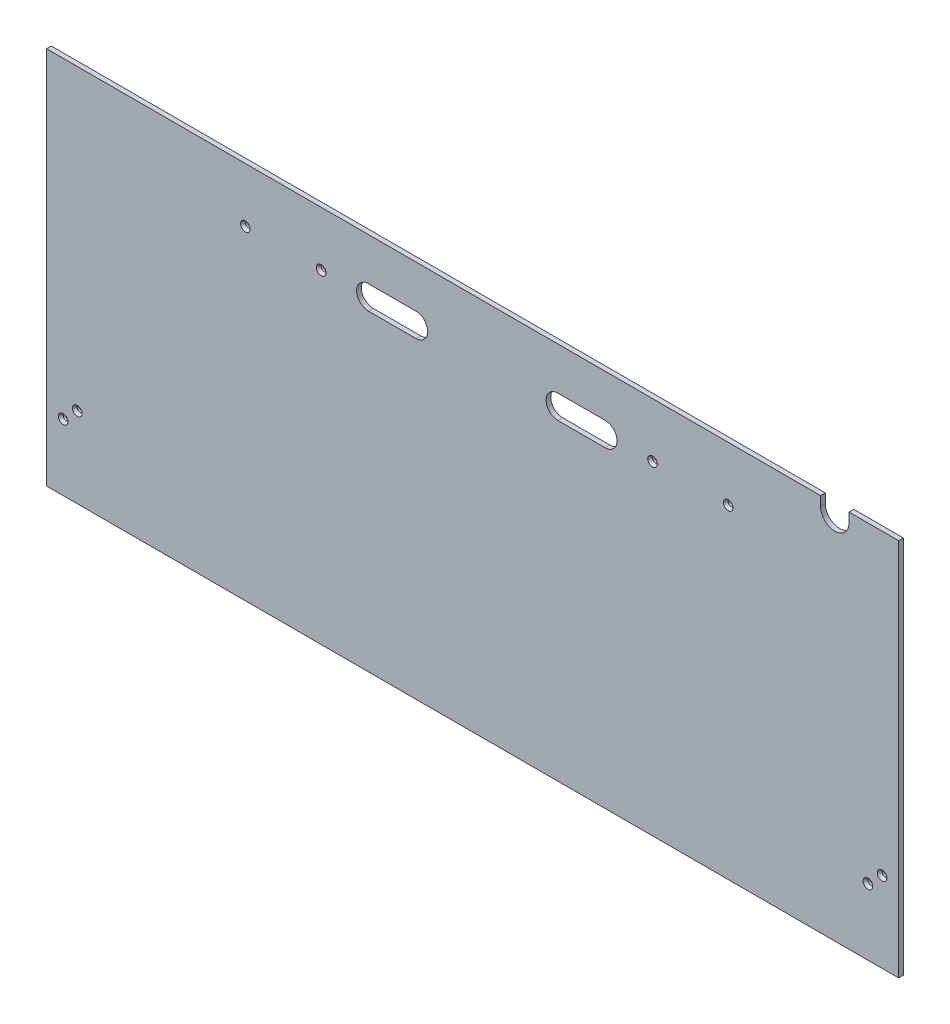
ISO-10303-21;
HEADER;
FILE_DESCRIPTION(('STEP AP214'),'2;1');
FILE_NAME('part.step','',(''),(''),'','','');
FILE_SCHEMA(('AUTOMOTIVE_DESIGN { 1 0 10303 214 1 1 1 1 }'));
ENDSEC;
DATA;
#1=APPLICATION_CONTEXT('core data for automotive mechanical design processes');
#2=APPLICATION_PROTOCOL_DEFINITION('international standard','automotive_design',2000,#1);
#3=PRODUCT_CONTEXT('',#1,'mechanical');
#4=PRODUCT('Part','Part','',(#3));
#5=PRODUCT_RELATED_PRODUCT_CATEGORY('part','',(#4));
#6=PRODUCT_DEFINITION_FORMATION('','',#4);
#7=PRODUCT_DEFINITION_CONTEXT('part definition',#1,'design');
#8=PRODUCT_DEFINITION('design','',#6,#7);
#9=PRODUCT_DEFINITION_SHAPE('','',#8);
#10=(LENGTH_UNIT() NAMED_UNIT(*) SI_UNIT(.MILLI.,.METRE.));
#11=(NAMED_UNIT(*) PLANE_ANGLE_UNIT() SI_UNIT($,.RADIAN.));
#12=(NAMED_UNIT(*) SI_UNIT($,.STERADIAN.) SOLID_ANGLE_UNIT());
#13=UNCERTAINTY_MEASURE_WITH_UNIT(LENGTH_MEASURE(1.E-05),#10,'distance_accuracy_value','');
#14=(GEOMETRIC_REPRESENTATION_CONTEXT(3) GLOBAL_UNCERTAINTY_ASSIGNED_CONTEXT((#13)) GLOBAL_UNIT_ASSIGNED_CONTEXT((#10,
#11,#12)) REPRESENTATION_CONTEXT('',''));
#15=CARTESIAN_POINT('',(0.,0.,0.));
#16=DIRECTION('',(0.,0.,1.));
#17=DIRECTION('',(1.,0.,0.));
#18=AXIS2_PLACEMENT_3D('',#15,#16,#17);
#19=CARTESIAN_POINT('',(0.,508.,6.35));
#20=DIRECTION('',(0.,-1.,0.));
#21=DIRECTION('',(0.,0.,-1.));
#22=AXIS2_PLACEMENT_3D('',#19,#20,#21);
#23=PLANE('',#22);
#24=DIRECTION('',(-1.,0.,0.));
#25=VECTOR('',#24,1.);
#26=CARTESIAN_POINT('',(0.,508.,6.35));
#27=LINE('',#26,#25);
#28=CARTESIAN_POINT('',(1038.225,508.,6.35));
#29=VERTEX_POINT('',#28);
#30=CARTESIAN_POINT('',(0.,508.,6.35));
#31=VERTEX_POINT('',#30);
#32=EDGE_CURVE('E326',#29,#31,#27,.T.);
#33=ORIENTED_EDGE('',*,*,#32,.F.);
#34=DIRECTION('',(0.,0.,1.));
#35=VECTOR('',#34,1.);
#36=CARTESIAN_POINT('',(1038.225,508.,0.));
#37=LINE('',#36,#35);
#38=CARTESIAN_POINT('',(1038.225,508.,0.));
#39=VERTEX_POINT('',#38);
#40=EDGE_CURVE('E177',#39,#29,#37,.T.);
#41=ORIENTED_EDGE('',*,*,#40,.F.);
#42=DIRECTION('',(-1.,0.,0.));
#43=VECTOR('',#42,1.);
#44=CARTESIAN_POINT('',(0.,508.,0.));
#45=LINE('',#44,#43);
#46=CARTESIAN_POINT('',(0.,508.,0.));
#47=VERTEX_POINT('',#46);
#48=EDGE_CURVE('E168',#39,#47,#45,.T.);
#49=ORIENTED_EDGE('',*,*,#48,.T.);
#50=DIRECTION('',(0.,0.,-1.));
#51=VECTOR('',#50,1.);
#52=CARTESIAN_POINT('',(0.,508.,6.35));
#53=LINE('',#52,#51);
#54=EDGE_CURVE('E330',#31,#47,#53,.T.);
#55=ORIENTED_EDGE('',*,*,#54,.F.);
#56=EDGE_LOOP('',(#33,#41,#49,#55));
#57=FACE_BOUND('',#56,.T.);
#58=ADVANCED_FACE('F34',(#57),#23,.F.);
#59=CARTESIAN_POINT('',(0.,0.,6.35));
#60=DIRECTION('',(0.,0.,-1.));
#61=DIRECTION('',(-1.,0.,0.));
#62=AXIS2_PLACEMENT_3D('',#59,#60,#61);
#63=PLANE('',#62);
#64=CARTESIAN_POINT('',(368.3,434.975,6.35));
#65=DIRECTION('',(0.,0.,1.));
#66=DIRECTION('',(1.,0.,0.));
#67=AXIS2_PLACEMENT_3D('',#64,#65,#66);
#68=CIRCLE('',#67,6.43890000000003);
#69=CARTESIAN_POINT('',(374.7389,434.975,6.35));
#70=VERTEX_POINT('',#69);
#71=EDGE_CURVE('E201',#70,#70,#68,.T.);
#72=ORIENTED_EDGE('',*,*,#71,.F.);
#73=EDGE_LOOP('',(#72));
#74=FACE_BOUND('',#73,.T.);
#75=DIRECTION('',(1.,0.,0.));
#76=VECTOR('',#75,1.);
#77=CARTESIAN_POINT('',(431.8,419.1,6.35));
#78=LINE('',#77,#76);
#79=CARTESIAN_POINT('',(431.8,419.1,6.35));
#80=VERTEX_POINT('',#79);
#81=CARTESIAN_POINT('',(495.3,419.1,6.35));
#82=VERTEX_POINT('',#81);
#83=EDGE_CURVE('E271',#80,#82,#78,.T.);
#84=ORIENTED_EDGE('',*,*,#83,.F.);
#85=CARTESIAN_POINT('',(431.8,434.975,6.35));
#86=DIRECTION('',(0.,0.,1.));
#87=DIRECTION('',(1.,0.,0.));
#88=AXIS2_PLACEMENT_3D('',#85,#86,#87);
#89=CIRCLE('',#88,15.875);
#90=CARTESIAN_POINT('',(431.8,450.85,6.35));
#91=VERTEX_POINT('',#90);
#92=EDGE_CURVE('E57',#91,#80,#89,.T.);
#93=ORIENTED_EDGE('',*,*,#92,.F.);
#94=DIRECTION('',(-1.,0.,0.));
#95=VECTOR('',#94,1.);
#96=CARTESIAN_POINT('',(431.8,450.85,6.35));
#97=LINE('',#96,#95);
#98=CARTESIAN_POINT('',(495.3,450.85,6.35));
#99=VERTEX_POINT('',#98);
#100=EDGE_CURVE('E260',#99,#91,#97,.T.);
#101=ORIENTED_EDGE('',*,*,#100,.F.);
#102=CARTESIAN_POINT('',(495.3,434.975,6.35));
#103=DIRECTION('',(0.,0.,1.));
#104=DIRECTION('',(1.,0.,0.));
#105=AXIS2_PLACEMENT_3D('',#102,#103,#104);
#106=CIRCLE('',#105,15.875);
#107=EDGE_CURVE('E275',#82,#99,#106,.T.);
#108=ORIENTED_EDGE('',*,*,#107,.F.);
#109=EDGE_LOOP('',(#84,#93,#101,#108));
#110=FACE_BOUND('',#109,.T.);
#111=DIRECTION('',(1.,0.,0.));
#112=VECTOR('',#111,1.);
#113=CARTESIAN_POINT('',(685.8,419.1,6.35));
#114=LINE('',#113,#112);
#115=CARTESIAN_POINT('',(685.8,419.1,6.35));
#116=VERTEX_POINT('',#115);
#117=CARTESIAN_POINT('',(749.3,419.1,6.35));
#118=VERTEX_POINT('',#117);
#119=EDGE_CURVE('E303',#116,#118,#114,.T.);
#120=ORIENTED_EDGE('',*,*,#119,.F.);
#121=CARTESIAN_POINT('',(685.8,434.975,6.35));
#122=DIRECTION('',(0.,0.,1.));
#123=DIRECTION('',(1.,0.,0.));
#124=AXIS2_PLACEMENT_3D('',#121,#122,#123);
#125=CIRCLE('',#124,15.875);
#126=CARTESIAN_POINT('',(685.8,450.85,6.35));
#127=VERTEX_POINT('',#126);
#128=EDGE_CURVE('E255',#127,#116,#125,.T.);
#129=ORIENTED_EDGE('',*,*,#128,.F.);
#130=DIRECTION('',(-1.,0.,0.));
#131=VECTOR('',#130,1.);
#132=CARTESIAN_POINT('',(685.8,450.85,6.35));
#133=LINE('',#132,#131);
#134=CARTESIAN_POINT('',(749.3,450.85,6.35));
#135=VERTEX_POINT('',#134);
#136=EDGE_CURVE('E292',#135,#127,#133,.T.);
#137=ORIENTED_EDGE('',*,*,#136,.F.);
#138=CARTESIAN_POINT('',(749.3,434.975,6.35));
#139=DIRECTION('',(0.,0.,1.));
#140=DIRECTION('',(1.,0.,0.));
#141=AXIS2_PLACEMENT_3D('',#138,#139,#140);
#142=CIRCLE('',#141,15.875);
#143=EDGE_CURVE('E306',#118,#135,#142,.T.);
#144=ORIENTED_EDGE('',*,*,#143,.F.);
#145=EDGE_LOOP('',(#120,#129,#137,#144));
#146=FACE_BOUND('',#145,.T.);
#147=CARTESIAN_POINT('',(1057.275,495.3,6.35));
#148=DIRECTION('',(0.,0.,1.));
#149=DIRECTION('',(-1.,0.,0.));
#150=AXIS2_PLACEMENT_3D('',#147,#148,#149);
#151=CIRCLE('',#150,19.05);
#152=CARTESIAN_POINT('',(1038.225,495.3,6.35));
#153=VERTEX_POINT('',#152);
#154=CARTESIAN_POINT('',(1076.325,495.3,6.35));
#155=VERTEX_POINT('',#154);
#156=EDGE_CURVE('E171',#153,#155,#151,.T.);
#157=ORIENTED_EDGE('',*,*,#156,.F.);
#158=DIRECTION('',(0.,-1.,0.));
#159=VECTOR('',#158,1.);
#160=CARTESIAN_POINT('',(1038.225,508.,6.35));
#161=LINE('',#160,#159);
#162=EDGE_CURVE('E153',#29,#153,#161,.T.);
#163=ORIENTED_EDGE('',*,*,#162,.F.);
#164=ORIENTED_EDGE('',*,*,#32,.T.);
#165=DIRECTION('',(0.,-1.,0.));
#166=VECTOR('',#165,1.);
#167=CARTESIAN_POINT('',(0.,0.,6.35));
#168=LINE('',#167,#166);
#169=CARTESIAN_POINT('',(0.,0.,6.35));
#170=VERTEX_POINT('',#169);
#171=EDGE_CURVE('E318',#31,#170,#168,.T.);
#172=ORIENTED_EDGE('',*,*,#171,.T.);
#173=DIRECTION('',(1.,0.,0.));
#174=VECTOR('',#173,1.);
#175=CARTESIAN_POINT('',(0.,0.,6.35));
#176=LINE('',#175,#174);
#177=CARTESIAN_POINT('',(1143.,0.,6.35));
#178=VERTEX_POINT('',#177);
#179=EDGE_CURVE('E321',#170,#178,#176,.T.);
#180=ORIENTED_EDGE('',*,*,#179,.T.);
#181=DIRECTION('',(0.,1.,0.));
#182=VECTOR('',#181,1.);
#183=CARTESIAN_POINT('',(1143.,0.,6.35));
#184=LINE('',#183,#182);
#185=CARTESIAN_POINT('',(1143.,508.,6.35));
#186=VERTEX_POINT('',#185);
#187=EDGE_CURVE('E324',#178,#186,#184,.T.);
#188=ORIENTED_EDGE('',*,*,#187,.T.);
#189=CARTESIAN_POINT('',(1076.325,508.,6.35));
#190=VERTEX_POINT('',#189);
#191=EDGE_CURVE('E327',#186,#190,#27,.T.);
#192=ORIENTED_EDGE('',*,*,#191,.T.);
#193=DIRECTION('',(0.,1.,0.));
#194=VECTOR('',#193,1.);
#195=CARTESIAN_POINT('',(1076.325,508.,6.35));
#196=LINE('',#195,#194);
#197=EDGE_CURVE('E169',#155,#190,#196,.T.);
#198=ORIENTED_EDGE('',*,*,#197,.F.);
#199=EDGE_LOOP('',(#157,#163,#164,#172,#180,#188,#192,#198));
#200=FACE_BOUND('',#199,.T.);
#201=CARTESIAN_POINT('',(22.2249999999999,88.9,6.35));
#202=DIRECTION('',(0.,0.,1.));
#203=DIRECTION('',(1.,0.,0.));
#204=AXIS2_PLACEMENT_3D('',#201,#202,#203);
#205=CIRCLE('',#204,6.4389);
#206=CARTESIAN_POINT('',(28.6638999999999,88.9,6.35));
#207=VERTEX_POINT('',#206);
#208=EDGE_CURVE('E246',#207,#207,#205,.T.);
#209=ORIENTED_EDGE('',*,*,#208,.F.);
#210=EDGE_LOOP('',(#209));
#211=FACE_BOUND('',#210,.T.);
#212=CARTESIAN_POINT('',(41.2749999999999,107.95,6.35));
#213=DIRECTION('',(0.,0.,1.));
#214=DIRECTION('',(1.,0.,0.));
#215=AXIS2_PLACEMENT_3D('',#212,#213,#214);
#216=CIRCLE('',#215,6.4389);
#217=CARTESIAN_POINT('',(47.7138999999999,107.95,6.35));
#218=VERTEX_POINT('',#217);
#219=EDGE_CURVE('E237',#218,#218,#216,.T.);
#220=ORIENTED_EDGE('',*,*,#219,.F.);
#221=EDGE_LOOP('',(#220));
#222=FACE_BOUND('',#221,.T.);
#223=CARTESIAN_POINT('',(1101.725,88.9,6.35));
#224=DIRECTION('',(0.,0.,1.));
#225=DIRECTION('',(1.,0.,0.));
#226=AXIS2_PLACEMENT_3D('',#223,#224,#225);
#227=CIRCLE('',#226,6.43890000000003);
#228=CARTESIAN_POINT('',(1108.1639,88.9,6.35));
#229=VERTEX_POINT('',#228);
#230=EDGE_CURVE('E228',#229,#229,#227,.T.);
#231=ORIENTED_EDGE('',*,*,#230,.F.);
#232=EDGE_LOOP('',(#231));
#233=FACE_BOUND('',#232,.T.);
#234=CARTESIAN_POINT('',(1120.775,107.95,6.35));
#235=DIRECTION('',(0.,0.,1.));
#236=DIRECTION('',(1.,0.,0.));
#237=AXIS2_PLACEMENT_3D('',#234,#235,#236);
#238=CIRCLE('',#237,6.43890000000003);
#239=CARTESIAN_POINT('',(1127.2139,107.95,6.35));
#240=VERTEX_POINT('',#239);
#241=EDGE_CURVE('E219',#240,#240,#238,.T.);
#242=ORIENTED_EDGE('',*,*,#241,.F.);
#243=EDGE_LOOP('',(#242));
#244=FACE_BOUND('',#243,.T.);
#245=CARTESIAN_POINT('',(266.7,434.975,6.35));
#246=DIRECTION('',(0.,0.,1.));
#247=DIRECTION('',(1.,0.,0.));
#248=AXIS2_PLACEMENT_3D('',#245,#246,#247);
#249=CIRCLE('',#248,6.43890000000003);
#250=CARTESIAN_POINT('',(273.1389,434.975,6.35));
#251=VERTEX_POINT('',#250);
#252=EDGE_CURVE('E210',#251,#251,#249,.T.);
#253=ORIENTED_EDGE('',*,*,#252,.F.);
#254=EDGE_LOOP('',(#253));
#255=FACE_BOUND('',#254,.T.);
#256=CARTESIAN_POINT('',(812.8,434.975,6.35));
#257=DIRECTION('',(0.,0.,1.));
#258=DIRECTION('',(1.,0.,0.));
#259=AXIS2_PLACEMENT_3D('',#256,#257,#258);
#260=CIRCLE('',#259,6.43890000000003);
#261=CARTESIAN_POINT('',(819.2389,434.975,6.35));
#262=VERTEX_POINT('',#261);
#263=EDGE_CURVE('E192',#262,#262,#260,.T.);
#264=ORIENTED_EDGE('',*,*,#263,.F.);
#265=EDGE_LOOP('',(#264));
#266=FACE_BOUND('',#265,.T.);
#267=CARTESIAN_POINT('',(914.4,434.975,6.35));
#268=DIRECTION('',(0.,0.,1.));
#269=DIRECTION('',(1.,0.,0.));
#270=AXIS2_PLACEMENT_3D('',#267,#268,#269);
#271=CIRCLE('',#270,6.43890000000003);
#272=CARTESIAN_POINT('',(920.8389,434.975,6.35));
#273=VERTEX_POINT('',#272);
#274=EDGE_CURVE('E179',#273,#273,#271,.T.);
#275=ORIENTED_EDGE('',*,*,#274,.F.);
#276=EDGE_LOOP('',(#275));
#277=FACE_BOUND('',#276,.T.);
#278=ADVANCED_FACE('F357',(#74,#110,#146,#200,#211,#222,#233,#244,#255,#266,#277),#63,.F.);
#279=CARTESIAN_POINT('',(0.,0.,6.35));
#280=DIRECTION('',(1.,0.,0.));
#281=DIRECTION('',(0.,0.,-1.));
#282=AXIS2_PLACEMENT_3D('',#279,#280,#281);
#283=PLANE('',#282);
#284=DIRECTION('',(0.,-1.,0.));
#285=VECTOR('',#284,1.);
#286=CARTESIAN_POINT('',(0.,0.,0.));
#287=LINE('',#286,#285);
#288=CARTESIAN_POINT('',(0.,0.,0.));
#289=VERTEX_POINT('',#288);
#290=EDGE_CURVE('E282',#47,#289,#287,.T.);
#291=ORIENTED_EDGE('',*,*,#290,.T.);
#292=DIRECTION('',(0.,0.,-1.));
#293=VECTOR('',#292,1.);
#294=CARTESIAN_POINT('',(0.,0.,6.35));
#295=LINE('',#294,#293);
#296=EDGE_CURVE('E11',#170,#289,#295,.T.);
#297=ORIENTED_EDGE('',*,*,#296,.F.);
#298=ORIENTED_EDGE('',*,*,#171,.F.);
#299=ORIENTED_EDGE('',*,*,#54,.T.);
#300=EDGE_LOOP('',(#291,#297,#298,#299));
#301=FACE_BOUND('',#300,.T.);
#302=ADVANCED_FACE('F36',(#301),#283,.F.);
#303=CARTESIAN_POINT('',(0.,0.,6.35));
#304=DIRECTION('',(0.,1.,0.));
#305=DIRECTION('',(0.,0.,1.));
#306=AXIS2_PLACEMENT_3D('',#303,#304,#305);
#307=PLANE('',#306);
#308=DIRECTION('',(1.,0.,0.));
#309=VECTOR('',#308,1.);
#310=CARTESIAN_POINT('',(0.,0.,0.));
#311=LINE('',#310,#309);
#312=CARTESIAN_POINT('',(1143.,0.,0.));
#313=VERTEX_POINT('',#312);
#314=EDGE_CURVE('E333',#289,#313,#311,.T.);
#315=ORIENTED_EDGE('',*,*,#314,.T.);
#316=DIRECTION('',(0.,0.,-1.));
#317=VECTOR('',#316,1.);
#318=CARTESIAN_POINT('',(1143.,0.,6.35));
#319=LINE('',#318,#317);
#320=EDGE_CURVE('E42',#178,#313,#319,.T.);
#321=ORIENTED_EDGE('',*,*,#320,.F.);
#322=ORIENTED_EDGE('',*,*,#179,.F.);
#323=ORIENTED_EDGE('',*,*,#296,.T.);
#324=EDGE_LOOP('',(#315,#321,#322,#323));
#325=FACE_BOUND('',#324,.T.);
#326=ADVANCED_FACE('F361',(#325),#307,.F.);
#327=CARTESIAN_POINT('',(1143.,0.,6.35));
#328=DIRECTION('',(-1.,0.,0.));
#329=DIRECTION('',(0.,0.,1.));
#330=AXIS2_PLACEMENT_3D('',#327,#328,#329);
#331=PLANE('',#330);
#332=DIRECTION('',(0.,1.,0.));
#333=VECTOR('',#332,1.);
#334=CARTESIAN_POINT('',(1143.,0.,0.));
#335=LINE('',#334,#333);
#336=CARTESIAN_POINT('',(1143.,508.,0.));
#337=VERTEX_POINT('',#336);
#338=EDGE_CURVE('E335',#313,#337,#335,.T.);
#339=ORIENTED_EDGE('',*,*,#338,.T.);
#340=DIRECTION('',(0.,0.,-1.));
#341=VECTOR('',#340,1.);
#342=CARTESIAN_POINT('',(1143.,508.,6.35));
#343=LINE('',#342,#341);
#344=EDGE_CURVE('E341',#186,#337,#343,.T.);
#345=ORIENTED_EDGE('',*,*,#344,.F.);
#346=ORIENTED_EDGE('',*,*,#187,.F.);
#347=ORIENTED_EDGE('',*,*,#320,.T.);
#348=EDGE_LOOP('',(#339,#345,#346,#347));
#349=FACE_BOUND('',#348,.T.);
#350=ADVANCED_FACE('F348',(#349),#331,.F.);
#351=CARTESIAN_POINT('',(1076.325,508.,0.));
#352=VERTEX_POINT('',#351);
#353=EDGE_CURVE('E322',#337,#352,#45,.T.);
#354=ORIENTED_EDGE('',*,*,#353,.T.);
#355=DIRECTION('',(0.,0.,1.));
#356=VECTOR('',#355,1.);
#357=CARTESIAN_POINT('',(1076.325,508.,0.));
#358=LINE('',#357,#356);
#359=EDGE_CURVE('E180',#352,#190,#358,.T.);
#360=ORIENTED_EDGE('',*,*,#359,.T.);
#361=ORIENTED_EDGE('',*,*,#191,.F.);
#362=ORIENTED_EDGE('',*,*,#344,.T.);
#363=EDGE_LOOP('',(#354,#360,#361,#362));
#364=FACE_BOUND('',#363,.T.);
#365=ADVANCED_FACE('F353',(#364),#23,.F.);
#366=CARTESIAN_POINT('',(0.,0.,0.));
#367=DIRECTION('',(0.,0.,-1.));
#368=DIRECTION('',(-1.,0.,0.));
#369=AXIS2_PLACEMENT_3D('',#366,#367,#368);
#370=PLANE('',#369);
#371=DIRECTION('',(0.,-1.,0.));
#372=VECTOR('',#371,1.);
#373=CARTESIAN_POINT('',(1038.225,508.,0.));
#374=LINE('',#373,#372);
#375=CARTESIAN_POINT('',(1038.225,495.3,0.));
#376=VERTEX_POINT('',#375);
#377=EDGE_CURVE('E150',#39,#376,#374,.T.);
#378=ORIENTED_EDGE('',*,*,#377,.T.);
#379=CARTESIAN_POINT('',(1057.275,495.3,0.));
#380=DIRECTION('',(0.,0.,1.));
#381=DIRECTION('',(-1.,0.,0.));
#382=AXIS2_PLACEMENT_3D('',#379,#380,#381);
#383=CIRCLE('',#382,19.05);
#384=CARTESIAN_POINT('',(1076.325,495.3,0.));
#385=VERTEX_POINT('',#384);
#386=EDGE_CURVE('E160',#376,#385,#383,.T.);
#387=ORIENTED_EDGE('',*,*,#386,.T.);
#388=DIRECTION('',(0.,1.,0.));
#389=VECTOR('',#388,1.);
#390=CARTESIAN_POINT('',(1076.325,508.,0.));
#391=LINE('',#390,#389);
#392=EDGE_CURVE('E49',#385,#352,#391,.T.);
#393=ORIENTED_EDGE('',*,*,#392,.T.);
#394=ORIENTED_EDGE('',*,*,#353,.F.);
#395=ORIENTED_EDGE('',*,*,#338,.F.);
#396=ORIENTED_EDGE('',*,*,#314,.F.);
#397=ORIENTED_EDGE('',*,*,#290,.F.);
#398=ORIENTED_EDGE('',*,*,#48,.F.);
#399=EDGE_LOOP('',(#378,#387,#393,#394,#395,#396,#397,#398));
#400=FACE_BOUND('',#399,.T.);
#401=CARTESIAN_POINT('',(914.4,434.975,0.));
#402=DIRECTION('',(0.,0.,-1.));
#403=DIRECTION('',(-1.,0.,0.));
#404=AXIS2_PLACEMENT_3D('',#401,#402,#403);
#405=CIRCLE('',#404,3.3782);
#406=CARTESIAN_POINT('',(911.0218,434.975,0.));
#407=VERTEX_POINT('',#406);
#408=EDGE_CURVE('E189',#407,#407,#405,.T.);
#409=ORIENTED_EDGE('',*,*,#408,.F.);
#410=EDGE_LOOP('',(#409));
#411=FACE_BOUND('',#410,.T.);
#412=CARTESIAN_POINT('',(812.8,434.975,0.));
#413=DIRECTION('',(0.,0.,-1.));
#414=DIRECTION('',(-1.,0.,0.));
#415=AXIS2_PLACEMENT_3D('',#412,#413,#414);
#416=CIRCLE('',#415,3.3782);
#417=CARTESIAN_POINT('',(809.4218,434.975,0.));
#418=VERTEX_POINT('',#417);
#419=EDGE_CURVE('E198',#418,#418,#416,.T.);
#420=ORIENTED_EDGE('',*,*,#419,.F.);
#421=EDGE_LOOP('',(#420));
#422=FACE_BOUND('',#421,.T.);
#423=CARTESIAN_POINT('',(368.3,434.975,0.));
#424=DIRECTION('',(0.,0.,-1.));
#425=DIRECTION('',(-1.,0.,0.));
#426=AXIS2_PLACEMENT_3D('',#423,#424,#425);
#427=CIRCLE('',#426,3.3782);
#428=CARTESIAN_POINT('',(364.9218,434.975,0.));
#429=VERTEX_POINT('',#428);
#430=EDGE_CURVE('E207',#429,#429,#427,.T.);
#431=ORIENTED_EDGE('',*,*,#430,.F.);
#432=EDGE_LOOP('',(#431));
#433=FACE_BOUND('',#432,.T.);
#434=CARTESIAN_POINT('',(266.7,434.975,0.));
#435=DIRECTION('',(0.,0.,-1.));
#436=DIRECTION('',(-1.,0.,0.));
#437=AXIS2_PLACEMENT_3D('',#434,#435,#436);
#438=CIRCLE('',#437,3.3782);
#439=CARTESIAN_POINT('',(263.3218,434.975,0.));
#440=VERTEX_POINT('',#439);
#441=EDGE_CURVE('E216',#440,#440,#438,.T.);
#442=ORIENTED_EDGE('',*,*,#441,.F.);
#443=EDGE_LOOP('',(#442));
#444=FACE_BOUND('',#443,.T.);
#445=CARTESIAN_POINT('',(1120.775,107.95,0.));
#446=DIRECTION('',(0.,0.,-1.));
#447=DIRECTION('',(-1.,0.,0.));
#448=AXIS2_PLACEMENT_3D('',#445,#446,#447);
#449=CIRCLE('',#448,3.3782);
#450=CARTESIAN_POINT('',(1117.3968,107.95,0.));
#451=VERTEX_POINT('',#450);
#452=EDGE_CURVE('E225',#451,#451,#449,.T.);
#453=ORIENTED_EDGE('',*,*,#452,.F.);
#454=EDGE_LOOP('',(#453));
#455=FACE_BOUND('',#454,.T.);
#456=CARTESIAN_POINT('',(1101.725,88.9,0.));
#457=DIRECTION('',(0.,0.,-1.));
#458=DIRECTION('',(-1.,0.,0.));
#459=AXIS2_PLACEMENT_3D('',#456,#457,#458);
#460=CIRCLE('',#459,3.3782);
#461=CARTESIAN_POINT('',(1098.3468,88.9,0.));
#462=VERTEX_POINT('',#461);
#463=EDGE_CURVE('E234',#462,#462,#460,.T.);
#464=ORIENTED_EDGE('',*,*,#463,.F.);
#465=EDGE_LOOP('',(#464));
#466=FACE_BOUND('',#465,.T.);
#467=CARTESIAN_POINT('',(41.2749999999999,107.95,0.));
#468=DIRECTION('',(0.,0.,-1.));
#469=DIRECTION('',(-1.,0.,0.));
#470=AXIS2_PLACEMENT_3D('',#467,#468,#469);
#471=CIRCLE('',#470,3.3782);
#472=CARTESIAN_POINT('',(37.8968,107.95,0.));
#473=VERTEX_POINT('',#472);
#474=EDGE_CURVE('E243',#473,#473,#471,.T.);
#475=ORIENTED_EDGE('',*,*,#474,.F.);
#476=EDGE_LOOP('',(#475));
#477=FACE_BOUND('',#476,.T.);
#478=CARTESIAN_POINT('',(22.2249999999999,88.9,0.));
#479=DIRECTION('',(0.,0.,-1.));
#480=DIRECTION('',(-1.,0.,0.));
#481=AXIS2_PLACEMENT_3D('',#478,#479,#480);
#482=CIRCLE('',#481,3.3782);
#483=CARTESIAN_POINT('',(18.8467999999999,88.9,0.));
#484=VERTEX_POINT('',#483);
#485=EDGE_CURVE('E252',#484,#484,#482,.T.);
#486=ORIENTED_EDGE('',*,*,#485,.F.);
#487=EDGE_LOOP('',(#486));
#488=FACE_BOUND('',#487,.T.);
#489=CARTESIAN_POINT('',(431.8,434.975,0.));
#490=DIRECTION('',(0.,0.,1.));
#491=DIRECTION('',(1.,0.,0.));
#492=AXIS2_PLACEMENT_3D('',#489,#490,#491);
#493=CIRCLE('',#492,15.875);
#494=CARTESIAN_POINT('',(431.8,450.85,0.));
#495=VERTEX_POINT('',#494);
#496=CARTESIAN_POINT('',(431.8,419.1,0.));
#497=VERTEX_POINT('',#496);
#498=EDGE_CURVE('E256',#495,#497,#493,.T.);
#499=ORIENTED_EDGE('',*,*,#498,.T.);
#500=DIRECTION('',(1.,0.,0.));
#501=VECTOR('',#500,1.);
#502=CARTESIAN_POINT('',(431.8,419.1,0.));
#503=LINE('',#502,#501);
#504=CARTESIAN_POINT('',(495.3,419.1,0.));
#505=VERTEX_POINT('',#504);
#506=EDGE_CURVE('E259',#497,#505,#503,.T.);
#507=ORIENTED_EDGE('',*,*,#506,.T.);
#508=CARTESIAN_POINT('',(495.3,434.975,0.));
#509=DIRECTION('',(0.,0.,1.));
#510=DIRECTION('',(1.,0.,0.));
#511=AXIS2_PLACEMENT_3D('',#508,#509,#510);
#512=CIRCLE('',#511,15.875);
#513=CARTESIAN_POINT('',(495.3,450.85,0.));
#514=VERTEX_POINT('',#513);
#515=EDGE_CURVE('E263',#505,#514,#512,.T.);
#516=ORIENTED_EDGE('',*,*,#515,.T.);
#517=DIRECTION('',(-1.,0.,0.));
#518=VECTOR('',#517,1.);
#519=CARTESIAN_POINT('',(431.8,450.85,0.));
#520=LINE('',#519,#518);
#521=EDGE_CURVE('E266',#514,#495,#520,.T.);
#522=ORIENTED_EDGE('',*,*,#521,.T.);
#523=EDGE_LOOP('',(#499,#507,#516,#522));
#524=FACE_BOUND('',#523,.T.);
#525=CARTESIAN_POINT('',(685.8,434.975,0.));
#526=DIRECTION('',(0.,0.,1.));
#527=DIRECTION('',(1.,0.,0.));
#528=AXIS2_PLACEMENT_3D('',#525,#526,#527);
#529=CIRCLE('',#528,15.875);
#530=CARTESIAN_POINT('',(685.8,450.85,0.));
#531=VERTEX_POINT('',#530);
#532=CARTESIAN_POINT('',(685.8,419.1,0.));
#533=VERTEX_POINT('',#532);
#534=EDGE_CURVE('E288',#531,#533,#529,.T.);
#535=ORIENTED_EDGE('',*,*,#534,.T.);
#536=DIRECTION('',(1.,0.,0.));
#537=VECTOR('',#536,1.);
#538=CARTESIAN_POINT('',(685.8,419.1,0.));
#539=LINE('',#538,#537);
#540=CARTESIAN_POINT('',(749.3,419.1,0.));
#541=VERTEX_POINT('',#540);
#542=EDGE_CURVE('E291',#533,#541,#539,.T.);
#543=ORIENTED_EDGE('',*,*,#542,.T.);
#544=CARTESIAN_POINT('',(749.3,434.975,0.));
#545=DIRECTION('',(0.,0.,1.));
#546=DIRECTION('',(1.,0.,0.));
#547=AXIS2_PLACEMENT_3D('',#544,#545,#546);
#548=CIRCLE('',#547,15.875);
#549=CARTESIAN_POINT('',(749.3,450.85,0.));
#550=VERTEX_POINT('',#549);
#551=EDGE_CURVE('E295',#541,#550,#548,.T.);
#552=ORIENTED_EDGE('',*,*,#551,.T.);
#553=DIRECTION('',(-1.,0.,0.));
#554=VECTOR('',#553,1.);
#555=CARTESIAN_POINT('',(685.8,450.85,0.));
#556=LINE('',#555,#554);
#557=EDGE_CURVE('E298',#550,#531,#556,.T.);
#558=ORIENTED_EDGE('',*,*,#557,.T.);
#559=EDGE_LOOP('',(#535,#543,#552,#558));
#560=FACE_BOUND('',#559,.T.);
#561=ADVANCED_FACE('F165',(#400,#411,#422,#433,#444,#455,#466,#477,#488,#524,#560),#370,.T.);
#562=CARTESIAN_POINT('',(685.8,434.975,0.));
#563=DIRECTION('',(0.,0.,1.));
#564=DIRECTION('',(1.,0.,0.));
#565=AXIS2_PLACEMENT_3D('',#562,#563,#564);
#566=CYLINDRICAL_SURFACE('',#565,15.875);
#567=ORIENTED_EDGE('',*,*,#128,.T.);
#568=DIRECTION('',(0.,0.,1.));
#569=VECTOR('',#568,1.);
#570=CARTESIAN_POINT('',(685.8,419.1,0.));
#571=LINE('',#570,#569);
#572=EDGE_CURVE('E301',#533,#116,#571,.T.);
#573=ORIENTED_EDGE('',*,*,#572,.F.);
#574=ORIENTED_EDGE('',*,*,#534,.F.);
#575=DIRECTION('',(0.,0.,1.));
#576=VECTOR('',#575,1.);
#577=CARTESIAN_POINT('',(685.8,450.85,0.));
#578=LINE('',#577,#576);
#579=EDGE_CURVE('E272',#531,#127,#578,.T.);
#580=ORIENTED_EDGE('',*,*,#579,.T.);
#581=EDGE_LOOP('',(#567,#573,#574,#580));
#582=FACE_BOUND('',#581,.T.);
#583=ADVANCED_FACE('F380',(#582),#566,.F.);
#584=CARTESIAN_POINT('',(685.8,450.85,0.));
#585=DIRECTION('',(0.,1.,0.));
#586=DIRECTION('',(0.,0.,1.));
#587=AXIS2_PLACEMENT_3D('',#584,#585,#586);
#588=PLANE('',#587);
#589=ORIENTED_EDGE('',*,*,#136,.T.);
#590=ORIENTED_EDGE('',*,*,#579,.F.);
#591=ORIENTED_EDGE('',*,*,#557,.F.);
#592=DIRECTION('',(0.,0.,1.));
#593=VECTOR('',#592,1.);
#594=CARTESIAN_POINT('',(749.3,450.85,0.));
#595=LINE('',#594,#593);
#596=EDGE_CURVE('E312',#550,#135,#595,.T.);
#597=ORIENTED_EDGE('',*,*,#596,.T.);
#598=EDGE_LOOP('',(#589,#590,#591,#597));
#599=FACE_BOUND('',#598,.T.);
#600=ADVANCED_FACE('F521',(#599),#588,.F.);
#601=CARTESIAN_POINT('',(749.3,434.975,0.));
#602=DIRECTION('',(0.,0.,1.));
#603=DIRECTION('',(1.,0.,0.));
#604=AXIS2_PLACEMENT_3D('',#601,#602,#603);
#605=CYLINDRICAL_SURFACE('',#604,15.875);
#606=ORIENTED_EDGE('',*,*,#143,.T.);
#607=ORIENTED_EDGE('',*,*,#596,.F.);
#608=ORIENTED_EDGE('',*,*,#551,.F.);
#609=DIRECTION('',(0.,0.,1.));
#610=VECTOR('',#609,1.);
#611=CARTESIAN_POINT('',(749.3,419.1,0.));
#612=LINE('',#611,#610);
#613=EDGE_CURVE('E314',#541,#118,#612,.T.);
#614=ORIENTED_EDGE('',*,*,#613,.T.);
#615=EDGE_LOOP('',(#606,#607,#608,#614));
#616=FACE_BOUND('',#615,.T.);
#617=ADVANCED_FACE('F524',(#616),#605,.F.);
#618=CARTESIAN_POINT('',(685.8,419.1,0.));
#619=DIRECTION('',(0.,-1.,0.));
#620=DIRECTION('',(0.,0.,-1.));
#621=AXIS2_PLACEMENT_3D('',#618,#619,#620);
#622=PLANE('',#621);
#623=ORIENTED_EDGE('',*,*,#119,.T.);
#624=ORIENTED_EDGE('',*,*,#613,.F.);
#625=ORIENTED_EDGE('',*,*,#542,.F.);
#626=ORIENTED_EDGE('',*,*,#572,.T.);
#627=EDGE_LOOP('',(#623,#624,#625,#626));
#628=FACE_BOUND('',#627,.T.);
#629=ADVANCED_FACE('F520',(#628),#622,.F.);
#630=CARTESIAN_POINT('',(431.8,434.975,0.));
#631=DIRECTION('',(0.,0.,1.));
#632=DIRECTION('',(1.,0.,0.));
#633=AXIS2_PLACEMENT_3D('',#630,#631,#632);
#634=CYLINDRICAL_SURFACE('',#633,15.875);
#635=ORIENTED_EDGE('',*,*,#92,.T.);
#636=DIRECTION('',(0.,0.,1.));
#637=VECTOR('',#636,1.);
#638=CARTESIAN_POINT('',(431.8,419.1,0.));
#639=LINE('',#638,#637);
#640=EDGE_CURVE('E269',#497,#80,#639,.T.);
#641=ORIENTED_EDGE('',*,*,#640,.F.);
#642=ORIENTED_EDGE('',*,*,#498,.F.);
#643=DIRECTION('',(0.,0.,1.));
#644=VECTOR('',#643,1.);
#645=CARTESIAN_POINT('',(431.8,450.85,0.));
#646=LINE('',#645,#644);
#647=EDGE_CURVE('E280',#495,#91,#646,.T.);
#648=ORIENTED_EDGE('',*,*,#647,.T.);
#649=EDGE_LOOP('',(#635,#641,#642,#648));
#650=FACE_BOUND('',#649,.T.);
#651=ADVANCED_FACE('F510',(#650),#634,.F.);
#652=CARTESIAN_POINT('',(431.8,450.85,0.));
#653=DIRECTION('',(0.,1.,0.));
#654=DIRECTION('',(0.,0.,1.));
#655=AXIS2_PLACEMENT_3D('',#652,#653,#654);
#656=PLANE('',#655);
#657=ORIENTED_EDGE('',*,*,#100,.T.);
#658=ORIENTED_EDGE('',*,*,#647,.F.);
#659=ORIENTED_EDGE('',*,*,#521,.F.);
#660=DIRECTION('',(0.,0.,1.));
#661=VECTOR('',#660,1.);
#662=CARTESIAN_POINT('',(495.3,450.85,0.));
#663=LINE('',#662,#661);
#664=EDGE_CURVE('E283',#514,#99,#663,.T.);
#665=ORIENTED_EDGE('',*,*,#664,.T.);
#666=EDGE_LOOP('',(#657,#658,#659,#665));
#667=FACE_BOUND('',#666,.T.);
#668=ADVANCED_FACE('F506',(#667),#656,.F.);
#669=CARTESIAN_POINT('',(495.3,434.975,0.));
#670=DIRECTION('',(0.,0.,1.));
#671=DIRECTION('',(1.,0.,0.));
#672=AXIS2_PLACEMENT_3D('',#669,#670,#671);
#673=CYLINDRICAL_SURFACE('',#672,15.875);
#674=ORIENTED_EDGE('',*,*,#107,.T.);
#675=ORIENTED_EDGE('',*,*,#664,.F.);
#676=ORIENTED_EDGE('',*,*,#515,.F.);
#677=DIRECTION('',(0.,0.,1.));
#678=VECTOR('',#677,1.);
#679=CARTESIAN_POINT('',(495.3,419.1,0.));
#680=LINE('',#679,#678);
#681=EDGE_CURVE('E285',#505,#82,#680,.T.);
#682=ORIENTED_EDGE('',*,*,#681,.T.);
#683=EDGE_LOOP('',(#674,#675,#676,#682));
#684=FACE_BOUND('',#683,.T.);
#685=ADVANCED_FACE('F509',(#684),#673,.F.);
#686=CARTESIAN_POINT('',(431.8,419.1,0.));
#687=DIRECTION('',(0.,-1.,0.));
#688=DIRECTION('',(0.,0.,-1.));
#689=AXIS2_PLACEMENT_3D('',#686,#687,#688);
#690=PLANE('',#689);
#691=ORIENTED_EDGE('',*,*,#83,.T.);
#692=ORIENTED_EDGE('',*,*,#681,.F.);
#693=ORIENTED_EDGE('',*,*,#506,.F.);
#694=ORIENTED_EDGE('',*,*,#640,.T.);
#695=EDGE_LOOP('',(#691,#692,#693,#694));
#696=FACE_BOUND('',#695,.T.);
#697=ADVANCED_FACE('F504',(#696),#690,.F.);
#698=CARTESIAN_POINT('',(22.2249999999999,88.9,6.35));
#699=DIRECTION('',(0.,0.,1.));
#700=DIRECTION('',(1.,0.,0.));
#701=AXIS2_PLACEMENT_3D('',#698,#699,#700);
#702=CYLINDRICAL_SURFACE('',#701,3.3782);
#703=CARTESIAN_POINT('',(22.2249999999999,88.9,2.82906741601866));
#704=DIRECTION('',(0.,0.,1.));
#705=DIRECTION('',(1.,0.,0.));
#706=AXIS2_PLACEMENT_3D('',#703,#704,#705);
#707=CIRCLE('',#706,3.3782);
#708=CARTESIAN_POINT('',(25.6031999999999,88.9,2.82906741601866));
#709=VERTEX_POINT('',#708);
#710=EDGE_CURVE('E249',#709,#709,#707,.T.);
#711=ORIENTED_EDGE('',*,*,#710,.T.);
#712=EDGE_LOOP('',(#711));
#713=FACE_BOUND('',#712,.T.);
#714=ORIENTED_EDGE('',*,*,#485,.T.);
#715=EDGE_LOOP('',(#714));
#716=FACE_BOUND('',#715,.T.);
#717=ADVANCED_FACE('F500',(#713,#716),#702,.F.);
#718=CARTESIAN_POINT('',(22.2249999999999,88.9,6.35));
#719=DIRECTION('',(0.,0.,1.));
#720=DIRECTION('',(1.,0.,0.));
#721=AXIS2_PLACEMENT_3D('',#718,#719,#720);
#722=CONICAL_SURFACE('',#721,6.4389,0.715584993317677);
#723=ORIENTED_EDGE('',*,*,#710,.F.);
#724=EDGE_LOOP('',(#723));
#725=FACE_BOUND('',#724,.T.);
#726=ORIENTED_EDGE('',*,*,#208,.T.);
#727=EDGE_LOOP('',(#726));
#728=FACE_BOUND('',#727,.T.);
#729=ADVANCED_FACE('F496',(#725,#728),#722,.F.);
#730=CARTESIAN_POINT('',(41.2749999999999,107.95,6.35));
#731=DIRECTION('',(0.,0.,1.));
#732=DIRECTION('',(1.,0.,0.));
#733=AXIS2_PLACEMENT_3D('',#730,#731,#732);
#734=CYLINDRICAL_SURFACE('',#733,3.3782);
#735=CARTESIAN_POINT('',(41.2749999999999,107.95,2.82906741601866));
#736=DIRECTION('',(0.,0.,1.));
#737=DIRECTION('',(1.,0.,0.));
#738=AXIS2_PLACEMENT_3D('',#735,#736,#737);
#739=CIRCLE('',#738,3.3782);
#740=CARTESIAN_POINT('',(44.6531999999999,107.95,2.82906741601866));
#741=VERTEX_POINT('',#740);
#742=EDGE_CURVE('E240',#741,#741,#739,.T.);
#743=ORIENTED_EDGE('',*,*,#742,.T.);
#744=EDGE_LOOP('',(#743));
#745=FACE_BOUND('',#744,.T.);
#746=ORIENTED_EDGE('',*,*,#474,.T.);
#747=EDGE_LOOP('',(#746));
#748=FACE_BOUND('',#747,.T.);
#749=ADVANCED_FACE('F492',(#745,#748),#734,.F.);
#750=CARTESIAN_POINT('',(41.2749999999999,107.95,6.35));
#751=DIRECTION('',(0.,0.,1.));
#752=DIRECTION('',(1.,0.,0.));
#753=AXIS2_PLACEMENT_3D('',#750,#751,#752);
#754=CONICAL_SURFACE('',#753,6.4389,0.715584993317676);
#755=ORIENTED_EDGE('',*,*,#742,.F.);
#756=EDGE_LOOP('',(#755));
#757=FACE_BOUND('',#756,.T.);
#758=ORIENTED_EDGE('',*,*,#219,.T.);
#759=EDGE_LOOP('',(#758));
#760=FACE_BOUND('',#759,.T.);
#761=ADVANCED_FACE('F488',(#757,#760),#754,.F.);
#762=CARTESIAN_POINT('',(1101.725,88.9,6.35));
#763=DIRECTION('',(0.,0.,1.));
#764=DIRECTION('',(1.,0.,0.));
#765=AXIS2_PLACEMENT_3D('',#762,#763,#764);
#766=CYLINDRICAL_SURFACE('',#765,3.3782);
#767=CARTESIAN_POINT('',(1101.725,88.9,2.82906741601866));
#768=DIRECTION('',(0.,0.,1.));
#769=DIRECTION('',(1.,0.,0.));
#770=AXIS2_PLACEMENT_3D('',#767,#768,#769);
#771=CIRCLE('',#770,3.3782);
#772=CARTESIAN_POINT('',(1105.1032,88.9,2.82906741601866));
#773=VERTEX_POINT('',#772);
#774=EDGE_CURVE('E231',#773,#773,#771,.T.);
#775=ORIENTED_EDGE('',*,*,#774,.T.);
#776=EDGE_LOOP('',(#775));
#777=FACE_BOUND('',#776,.T.);
#778=ORIENTED_EDGE('',*,*,#463,.T.);
#779=EDGE_LOOP('',(#778));
#780=FACE_BOUND('',#779,.T.);
#781=ADVANCED_FACE('F484',(#777,#780),#766,.F.);
#782=CARTESIAN_POINT('',(1101.725,88.9,6.35));
#783=DIRECTION('',(0.,0.,1.));
#784=DIRECTION('',(1.,0.,0.));
#785=AXIS2_PLACEMENT_3D('',#782,#783,#784);
#786=CONICAL_SURFACE('',#785,6.43890000000003,0.715584993317681);
#787=ORIENTED_EDGE('',*,*,#774,.F.);
#788=EDGE_LOOP('',(#787));
#789=FACE_BOUND('',#788,.T.);
#790=ORIENTED_EDGE('',*,*,#230,.T.);
#791=EDGE_LOOP('',(#790));
#792=FACE_BOUND('',#791,.T.);
#793=ADVANCED_FACE('F480',(#789,#792),#786,.F.);
#794=CARTESIAN_POINT('',(1120.775,107.95,6.35));
#795=DIRECTION('',(0.,0.,1.));
#796=DIRECTION('',(1.,0.,0.));
#797=AXIS2_PLACEMENT_3D('',#794,#795,#796);
#798=CYLINDRICAL_SURFACE('',#797,3.3782);
#799=CARTESIAN_POINT('',(1120.775,107.95,2.82906741601866));
#800=DIRECTION('',(0.,0.,1.));
#801=DIRECTION('',(1.,0.,0.));
#802=AXIS2_PLACEMENT_3D('',#799,#800,#801);
#803=CIRCLE('',#802,3.3782);
#804=CARTESIAN_POINT('',(1124.1532,107.95,2.82906741601866));
#805=VERTEX_POINT('',#804);
#806=EDGE_CURVE('E222',#805,#805,#803,.T.);
#807=ORIENTED_EDGE('',*,*,#806,.T.);
#808=EDGE_LOOP('',(#807));
#809=FACE_BOUND('',#808,.T.);
#810=ORIENTED_EDGE('',*,*,#452,.T.);
#811=EDGE_LOOP('',(#810));
#812=FACE_BOUND('',#811,.T.);
#813=ADVANCED_FACE('F476',(#809,#812),#798,.F.);
#814=CARTESIAN_POINT('',(1120.775,107.95,6.35));
#815=DIRECTION('',(0.,0.,1.));
#816=DIRECTION('',(1.,0.,0.));
#817=AXIS2_PLACEMENT_3D('',#814,#815,#816);
#818=CONICAL_SURFACE('',#817,6.43890000000003,0.715584993317681);
#819=ORIENTED_EDGE('',*,*,#806,.F.);
#820=EDGE_LOOP('',(#819));
#821=FACE_BOUND('',#820,.T.);
#822=ORIENTED_EDGE('',*,*,#241,.T.);
#823=EDGE_LOOP('',(#822));
#824=FACE_BOUND('',#823,.T.);
#825=ADVANCED_FACE('F472',(#821,#824),#818,.F.);
#826=CARTESIAN_POINT('',(266.7,434.975,6.35));
#827=DIRECTION('',(0.,0.,1.));
#828=DIRECTION('',(1.,0.,0.));
#829=AXIS2_PLACEMENT_3D('',#826,#827,#828);
#830=CYLINDRICAL_SURFACE('',#829,3.3782);
#831=CARTESIAN_POINT('',(266.7,434.975,2.82906741601866));
#832=DIRECTION('',(0.,0.,1.));
#833=DIRECTION('',(1.,0.,0.));
#834=AXIS2_PLACEMENT_3D('',#831,#832,#833);
#835=CIRCLE('',#834,3.3782);
#836=CARTESIAN_POINT('',(270.0782,434.975,2.82906741601866));
#837=VERTEX_POINT('',#836);
#838=EDGE_CURVE('E213',#837,#837,#835,.T.);
#839=ORIENTED_EDGE('',*,*,#838,.T.);
#840=EDGE_LOOP('',(#839));
#841=FACE_BOUND('',#840,.T.);
#842=ORIENTED_EDGE('',*,*,#441,.T.);
#843=EDGE_LOOP('',(#842));
#844=FACE_BOUND('',#843,.T.);
#845=ADVANCED_FACE('F468',(#841,#844),#830,.F.);
#846=CARTESIAN_POINT('',(266.7,434.975,6.35));
#847=DIRECTION('',(0.,0.,1.));
#848=DIRECTION('',(1.,0.,0.));
#849=AXIS2_PLACEMENT_3D('',#846,#847,#848);
#850=CONICAL_SURFACE('',#849,6.43890000000003,0.715584993317681);
#851=ORIENTED_EDGE('',*,*,#838,.F.);
#852=EDGE_LOOP('',(#851));
#853=FACE_BOUND('',#852,.T.);
#854=ORIENTED_EDGE('',*,*,#252,.T.);
#855=EDGE_LOOP('',(#854));
#856=FACE_BOUND('',#855,.T.);
#857=ADVANCED_FACE('F464',(#853,#856),#850,.F.);
#858=CARTESIAN_POINT('',(368.3,434.975,6.35));
#859=DIRECTION('',(0.,0.,1.));
#860=DIRECTION('',(1.,0.,0.));
#861=AXIS2_PLACEMENT_3D('',#858,#859,#860);
#862=CYLINDRICAL_SURFACE('',#861,3.3782);
#863=CARTESIAN_POINT('',(368.3,434.975,2.82906741601866));
#864=DIRECTION('',(0.,0.,1.));
#865=DIRECTION('',(1.,0.,0.));
#866=AXIS2_PLACEMENT_3D('',#863,#864,#865);
#867=CIRCLE('',#866,3.3782);
#868=CARTESIAN_POINT('',(371.6782,434.975,2.82906741601866));
#869=VERTEX_POINT('',#868);
#870=EDGE_CURVE('E204',#869,#869,#867,.T.);
#871=ORIENTED_EDGE('',*,*,#870,.T.);
#872=EDGE_LOOP('',(#871));
#873=FACE_BOUND('',#872,.T.);
#874=ORIENTED_EDGE('',*,*,#430,.T.);
#875=EDGE_LOOP('',(#874));
#876=FACE_BOUND('',#875,.T.);
#877=ADVANCED_FACE('F460',(#873,#876),#862,.F.);
#878=CARTESIAN_POINT('',(368.3,434.975,6.35));
#879=DIRECTION('',(0.,0.,1.));
#880=DIRECTION('',(1.,0.,0.));
#881=AXIS2_PLACEMENT_3D('',#878,#879,#880);
#882=CONICAL_SURFACE('',#881,6.43890000000003,0.715584993317681);
#883=ORIENTED_EDGE('',*,*,#870,.F.);
#884=EDGE_LOOP('',(#883));
#885=FACE_BOUND('',#884,.T.);
#886=ORIENTED_EDGE('',*,*,#71,.T.);
#887=EDGE_LOOP('',(#886));
#888=FACE_BOUND('',#887,.T.);
#889=ADVANCED_FACE('F456',(#885,#888),#882,.F.);
#890=CARTESIAN_POINT('',(812.8,434.975,6.35));
#891=DIRECTION('',(0.,0.,1.));
#892=DIRECTION('',(1.,0.,0.));
#893=AXIS2_PLACEMENT_3D('',#890,#891,#892);
#894=CYLINDRICAL_SURFACE('',#893,3.3782);
#895=CARTESIAN_POINT('',(812.8,434.975,2.82906741601866));
#896=DIRECTION('',(0.,0.,1.));
#897=DIRECTION('',(1.,0.,0.));
#898=AXIS2_PLACEMENT_3D('',#895,#896,#897);
#899=CIRCLE('',#898,3.3782);
#900=CARTESIAN_POINT('',(816.1782,434.975,2.82906741601866));
#901=VERTEX_POINT('',#900);
#902=EDGE_CURVE('E195',#901,#901,#899,.T.);
#903=ORIENTED_EDGE('',*,*,#902,.T.);
#904=EDGE_LOOP('',(#903));
#905=FACE_BOUND('',#904,.T.);
#906=ORIENTED_EDGE('',*,*,#419,.T.);
#907=EDGE_LOOP('',(#906));
#908=FACE_BOUND('',#907,.T.);
#909=ADVANCED_FACE('F452',(#905,#908),#894,.F.);
#910=CARTESIAN_POINT('',(812.8,434.975,6.35));
#911=DIRECTION('',(0.,0.,1.));
#912=DIRECTION('',(1.,0.,0.));
#913=AXIS2_PLACEMENT_3D('',#910,#911,#912);
#914=CONICAL_SURFACE('',#913,6.43890000000003,0.715584993317681);
#915=ORIENTED_EDGE('',*,*,#902,.F.);
#916=EDGE_LOOP('',(#915));
#917=FACE_BOUND('',#916,.T.);
#918=ORIENTED_EDGE('',*,*,#263,.T.);
#919=EDGE_LOOP('',(#918));
#920=FACE_BOUND('',#919,.T.);
#921=ADVANCED_FACE('F448',(#917,#920),#914,.F.);
#922=CARTESIAN_POINT('',(914.4,434.975,6.35));
#923=DIRECTION('',(0.,0.,1.));
#924=DIRECTION('',(1.,0.,0.));
#925=AXIS2_PLACEMENT_3D('',#922,#923,#924);
#926=CYLINDRICAL_SURFACE('',#925,3.3782);
#927=CARTESIAN_POINT('',(914.4,434.975,2.82906741601866));
#928=DIRECTION('',(0.,0.,1.));
#929=DIRECTION('',(1.,0.,0.));
#930=AXIS2_PLACEMENT_3D('',#927,#928,#929);
#931=CIRCLE('',#930,3.3782);
#932=CARTESIAN_POINT('',(917.7782,434.975,2.82906741601866));
#933=VERTEX_POINT('',#932);
#934=EDGE_CURVE('E186',#933,#933,#931,.T.);
#935=ORIENTED_EDGE('',*,*,#934,.T.);
#936=EDGE_LOOP('',(#935));
#937=FACE_BOUND('',#936,.T.);
#938=ORIENTED_EDGE('',*,*,#408,.T.);
#939=EDGE_LOOP('',(#938));
#940=FACE_BOUND('',#939,.T.);
#941=ADVANCED_FACE('F444',(#937,#940),#926,.F.);
#942=CARTESIAN_POINT('',(914.4,434.975,6.35));
#943=DIRECTION('',(0.,0.,1.));
#944=DIRECTION('',(1.,0.,0.));
#945=AXIS2_PLACEMENT_3D('',#942,#943,#944);
#946=CONICAL_SURFACE('',#945,6.43890000000003,0.715584993317681);
#947=ORIENTED_EDGE('',*,*,#934,.F.);
#948=EDGE_LOOP('',(#947));
#949=FACE_BOUND('',#948,.T.);
#950=ORIENTED_EDGE('',*,*,#274,.T.);
#951=EDGE_LOOP('',(#950));
#952=FACE_BOUND('',#951,.T.);
#953=ADVANCED_FACE('F421',(#949,#952),#946,.F.);
#954=CARTESIAN_POINT('',(1038.225,508.,0.));
#955=DIRECTION('',(-1.,0.,0.));
#956=DIRECTION('',(0.,0.,1.));
#957=AXIS2_PLACEMENT_3D('',#954,#955,#956);
#958=PLANE('',#957);
#959=ORIENTED_EDGE('',*,*,#162,.T.);
#960=DIRECTION('',(0.,0.,1.));
#961=VECTOR('',#960,1.);
#962=CARTESIAN_POINT('',(1038.225,495.3,0.));
#963=LINE('',#962,#961);
#964=EDGE_CURVE('E146',#376,#153,#963,.T.);
#965=ORIENTED_EDGE('',*,*,#964,.F.);
#966=ORIENTED_EDGE('',*,*,#377,.F.);
#967=ORIENTED_EDGE('',*,*,#40,.T.);
#968=EDGE_LOOP('',(#959,#965,#966,#967));
#969=FACE_BOUND('',#968,.T.);
#970=ADVANCED_FACE('F148',(#969),#958,.F.);
#971=CARTESIAN_POINT('',(1076.325,508.,0.));
#972=DIRECTION('',(1.,0.,0.));
#973=DIRECTION('',(0.,0.,-1.));
#974=AXIS2_PLACEMENT_3D('',#971,#972,#973);
#975=PLANE('',#974);
#976=ORIENTED_EDGE('',*,*,#197,.T.);
#977=ORIENTED_EDGE('',*,*,#359,.F.);
#978=ORIENTED_EDGE('',*,*,#392,.F.);
#979=DIRECTION('',(0.,0.,1.));
#980=VECTOR('',#979,1.);
#981=CARTESIAN_POINT('',(1076.325,495.3,0.));
#982=LINE('',#981,#980);
#983=EDGE_CURVE('E157',#385,#155,#982,.T.);
#984=ORIENTED_EDGE('',*,*,#983,.T.);
#985=EDGE_LOOP('',(#976,#977,#978,#984));
#986=FACE_BOUND('',#985,.T.);
#987=ADVANCED_FACE('F420',(#986),#975,.F.);
#988=CARTESIAN_POINT('',(1057.275,495.3,0.));
#989=DIRECTION('',(0.,0.,1.));
#990=DIRECTION('',(1.,0.,0.));
#991=AXIS2_PLACEMENT_3D('',#988,#989,#990);
#992=CYLINDRICAL_SURFACE('',#991,19.05);
#993=ORIENTED_EDGE('',*,*,#156,.T.);
#994=ORIENTED_EDGE('',*,*,#983,.F.);
#995=ORIENTED_EDGE('',*,*,#386,.F.);
#996=ORIENTED_EDGE('',*,*,#964,.T.);
#997=EDGE_LOOP('',(#993,#994,#995,#996));
#998=FACE_BOUND('',#997,.T.);
#999=ADVANCED_FACE('F161',(#998),#992,.F.);
#1000=CLOSED_SHELL('',(#58,#278,#302,#326,#350,#365,#561,#583,#600,#617,#629,#651,#668,#685,
#697,#717,#729,#749,#761,#781,#793,#813,#825,#845,#857,#877,#889,#909,#921,#941,#953,#970,#987,#999));
#1001=MANIFOLD_SOLID_BREP('B2',#1000);
#1002=ADVANCED_BREP_SHAPE_REPRESENTATION('',(#18,#1001),#14);
#1003=SHAPE_DEFINITION_REPRESENTATION(#9,#1002);
ENDSEC;
END-ISO-10303-21;
